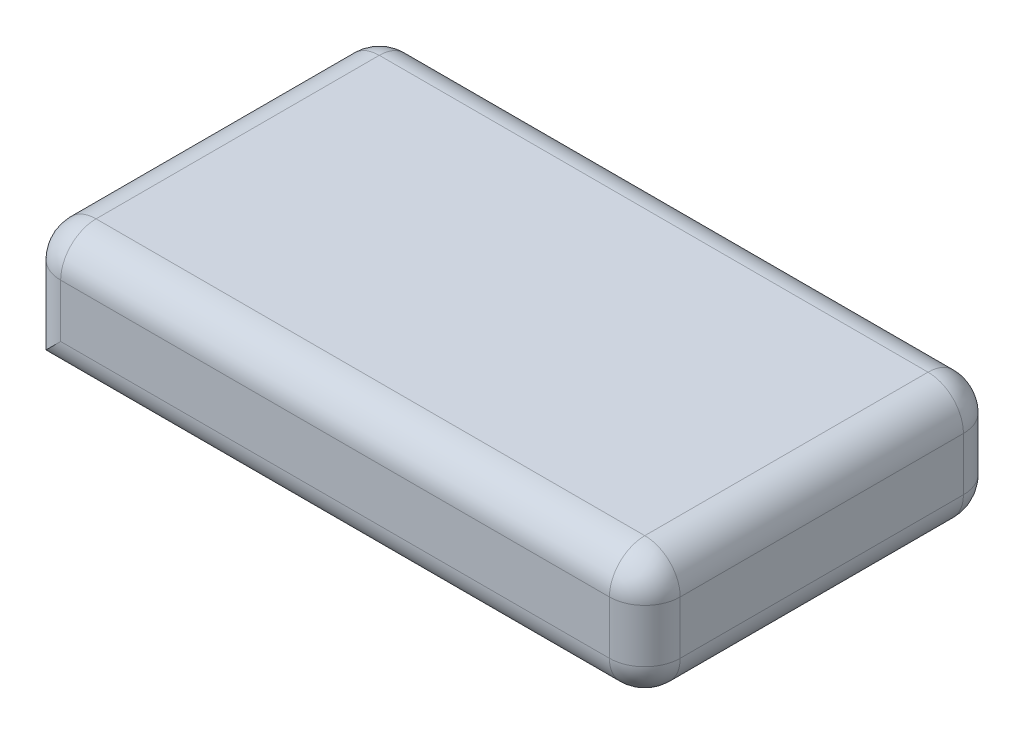
ISO-10303-21;
HEADER;
FILE_DESCRIPTION(('STEP AP214'),'2;1');
FILE_NAME('part.step','',(''),(''),'','','');
FILE_SCHEMA(('AUTOMOTIVE_DESIGN { 1 0 10303 214 1 1 1 1 }'));
ENDSEC;
DATA;
#1=APPLICATION_CONTEXT('core data for automotive mechanical design processes');
#2=APPLICATION_PROTOCOL_DEFINITION('international standard','automotive_design',2000,#1);
#3=PRODUCT_CONTEXT('',#1,'mechanical');
#4=PRODUCT('Part','Part','',(#3));
#5=PRODUCT_RELATED_PRODUCT_CATEGORY('part','',(#4));
#6=PRODUCT_DEFINITION_FORMATION('','',#4);
#7=PRODUCT_DEFINITION_CONTEXT('part definition',#1,'design');
#8=PRODUCT_DEFINITION('design','',#6,#7);
#9=PRODUCT_DEFINITION_SHAPE('','',#8);
#10=(LENGTH_UNIT() NAMED_UNIT(*) SI_UNIT(.MILLI.,.METRE.));
#11=(NAMED_UNIT(*) PLANE_ANGLE_UNIT() SI_UNIT($,.RADIAN.));
#12=(NAMED_UNIT(*) SI_UNIT($,.STERADIAN.) SOLID_ANGLE_UNIT());
#13=UNCERTAINTY_MEASURE_WITH_UNIT(LENGTH_MEASURE(1.E-05),#10,'distance_accuracy_value','');
#14=(GEOMETRIC_REPRESENTATION_CONTEXT(3) GLOBAL_UNCERTAINTY_ASSIGNED_CONTEXT((#13)) GLOBAL_UNIT_ASSIGNED_CONTEXT((#10,
#11,#12)) REPRESENTATION_CONTEXT('',''));
#15=CARTESIAN_POINT('',(0.,0.,0.));
#16=DIRECTION('',(0.,0.,1.));
#17=DIRECTION('',(1.,0.,0.));
#18=AXIS2_PLACEMENT_3D('',#15,#16,#17);
#19=CARTESIAN_POINT('',(17.5,7.,10.));
#20=DIRECTION('',(-1.,0.,0.));
#21=DIRECTION('',(0.,0.,1.));
#22=AXIS2_PLACEMENT_3D('',#19,#20,#21);
#23=PLANE('',#22);
#24=DIRECTION('',(0.,0.,-1.));
#25=VECTOR('',#24,1.);
#26=CARTESIAN_POINT('',(17.5,2.,-10.));
#27=LINE('',#26,#25);
#28=CARTESIAN_POINT('',(17.5,2.,8.));
#29=VERTEX_POINT('',#28);
#30=CARTESIAN_POINT('',(17.5,2.,-8.));
#31=VERTEX_POINT('',#30);
#32=EDGE_CURVE('E42',#29,#31,#27,.T.);
#33=ORIENTED_EDGE('',*,*,#32,.T.);
#34=DIRECTION('',(0.,-1.,0.));
#35=VECTOR('',#34,1.);
#36=CARTESIAN_POINT('',(17.5,7.,-8.));
#37=LINE('',#36,#35);
#38=CARTESIAN_POINT('',(17.5,5.,-8.));
#39=VERTEX_POINT('',#38);
#40=EDGE_CURVE('E11',#31,#39,#37,.F.);
#41=ORIENTED_EDGE('',*,*,#40,.T.);
#42=DIRECTION('',(0.,0.,-1.));
#43=VECTOR('',#42,1.);
#44=CARTESIAN_POINT('',(17.5,5.,10.));
#45=LINE('',#44,#43);
#46=CARTESIAN_POINT('',(17.5,5.,8.));
#47=VERTEX_POINT('',#46);
#48=EDGE_CURVE('E188',#39,#47,#45,.F.);
#49=ORIENTED_EDGE('',*,*,#48,.T.);
#50=DIRECTION('',(0.,-1.,0.));
#51=VECTOR('',#50,1.);
#52=CARTESIAN_POINT('',(17.5,7.,8.));
#53=LINE('',#52,#51);
#54=EDGE_CURVE('E186',#47,#29,#53,.T.);
#55=ORIENTED_EDGE('',*,*,#54,.T.);
#56=EDGE_LOOP('',(#33,#41,#49,#55));
#57=FACE_BOUND('',#56,.T.);
#58=ADVANCED_FACE('F33',(#57),#23,.F.);
#59=CARTESIAN_POINT('',(-17.5,7.,-10.));
#60=DIRECTION('',(0.,0.,1.));
#61=DIRECTION('',(1.,0.,0.));
#62=AXIS2_PLACEMENT_3D('',#59,#60,#61);
#63=PLANE('',#62);
#64=DIRECTION('',(-1.,0.,0.));
#65=VECTOR('',#64,1.);
#66=CARTESIAN_POINT('',(-17.5,2.,-10.));
#67=LINE('',#66,#65);
#68=CARTESIAN_POINT('',(15.5,2.,-10.));
#69=VERTEX_POINT('',#68);
#70=CARTESIAN_POINT('',(-15.5,2.,-10.));
#71=VERTEX_POINT('',#70);
#72=EDGE_CURVE('E163',#69,#71,#67,.T.);
#73=ORIENTED_EDGE('',*,*,#72,.T.);
#74=DIRECTION('',(0.,-1.,0.));
#75=VECTOR('',#74,1.);
#76=CARTESIAN_POINT('',(-15.5,7.,-10.));
#77=LINE('',#76,#75);
#78=CARTESIAN_POINT('',(-15.5,5.,-10.));
#79=VERTEX_POINT('',#78);
#80=EDGE_CURVE('E125',#71,#79,#77,.F.);
#81=ORIENTED_EDGE('',*,*,#80,.T.);
#82=DIRECTION('',(-1.,0.,0.));
#83=VECTOR('',#82,1.);
#84=CARTESIAN_POINT('',(-17.5,5.,-10.));
#85=LINE('',#84,#83);
#86=CARTESIAN_POINT('',(15.5,5.,-10.));
#87=VERTEX_POINT('',#86);
#88=EDGE_CURVE('E161',#79,#87,#85,.F.);
#89=ORIENTED_EDGE('',*,*,#88,.T.);
#90=DIRECTION('',(0.,-1.,0.));
#91=VECTOR('',#90,1.);
#92=CARTESIAN_POINT('',(15.5,7.,-10.));
#93=LINE('',#92,#91);
#94=EDGE_CURVE('E149',#87,#69,#93,.T.);
#95=ORIENTED_EDGE('',*,*,#94,.T.);
#96=EDGE_LOOP('',(#73,#81,#89,#95));
#97=FACE_BOUND('',#96,.T.);
#98=ADVANCED_FACE('F257',(#97),#63,.F.);
#99=CARTESIAN_POINT('',(-17.5,7.,10.));
#100=DIRECTION('',(1.,0.,0.));
#101=DIRECTION('',(0.,0.,-1.));
#102=AXIS2_PLACEMENT_3D('',#99,#100,#101);
#103=PLANE('',#102);
#104=DIRECTION('',(0.,0.,1.));
#105=VECTOR('',#104,1.);
#106=CARTESIAN_POINT('',(-17.5,5.,10.));
#107=LINE('',#106,#105);
#108=CARTESIAN_POINT('',(-17.5,5.,8.));
#109=VERTEX_POINT('',#108);
#110=CARTESIAN_POINT('',(-17.5,5.,-8.));
#111=VERTEX_POINT('',#110);
#112=EDGE_CURVE('E147',#109,#111,#107,.F.);
#113=ORIENTED_EDGE('',*,*,#112,.T.);
#114=DIRECTION('',(0.,-1.,0.));
#115=VECTOR('',#114,1.);
#116=CARTESIAN_POINT('',(-17.5,7.,-8.));
#117=LINE('',#116,#115);
#118=CARTESIAN_POINT('',(-17.5,0.,-8.));
#119=VERTEX_POINT('',#118);
#120=EDGE_CURVE('E123',#111,#119,#117,.T.);
#121=ORIENTED_EDGE('',*,*,#120,.T.);
#122=DIRECTION('',(0.,0.,1.));
#123=VECTOR('',#122,1.);
#124=CARTESIAN_POINT('',(-17.5,0.,10.));
#125=LINE('',#124,#123);
#126=CARTESIAN_POINT('',(-17.5,0.,8.));
#127=VERTEX_POINT('',#126);
#128=EDGE_CURVE('E144',#119,#127,#125,.T.);
#129=ORIENTED_EDGE('',*,*,#128,.T.);
#130=DIRECTION('',(0.,-1.,0.));
#131=VECTOR('',#130,1.);
#132=CARTESIAN_POINT('',(-17.5,7.,8.));
#133=LINE('',#132,#131);
#134=EDGE_CURVE('E150',#127,#109,#133,.F.);
#135=ORIENTED_EDGE('',*,*,#134,.T.);
#136=EDGE_LOOP('',(#113,#121,#129,#135));
#137=FACE_BOUND('',#136,.T.);
#138=ADVANCED_FACE('F143',(#137),#103,.F.);
#139=CARTESIAN_POINT('',(-17.5,7.,10.));
#140=DIRECTION('',(0.,0.,-1.));
#141=DIRECTION('',(-1.,0.,0.));
#142=AXIS2_PLACEMENT_3D('',#139,#140,#141);
#143=PLANE('',#142);
#144=DIRECTION('',(0.,-1.,0.));
#145=VECTOR('',#144,1.);
#146=CARTESIAN_POINT('',(-15.5,7.,10.));
#147=LINE('',#146,#145);
#148=CARTESIAN_POINT('',(-15.5,5.,10.));
#149=VERTEX_POINT('',#148);
#150=CARTESIAN_POINT('',(-15.5,2.,10.));
#151=VERTEX_POINT('',#150);
#152=EDGE_CURVE('E168',#149,#151,#147,.T.);
#153=ORIENTED_EDGE('',*,*,#152,.T.);
#154=DIRECTION('',(1.,0.,0.));
#155=VECTOR('',#154,1.);
#156=CARTESIAN_POINT('',(17.5,2.,10.));
#157=LINE('',#156,#155);
#158=CARTESIAN_POINT('',(15.5,2.,10.));
#159=VERTEX_POINT('',#158);
#160=EDGE_CURVE('E172',#151,#159,#157,.T.);
#161=ORIENTED_EDGE('',*,*,#160,.T.);
#162=DIRECTION('',(0.,-1.,0.));
#163=VECTOR('',#162,1.);
#164=CARTESIAN_POINT('',(15.5,7.,10.));
#165=LINE('',#164,#163);
#166=CARTESIAN_POINT('',(15.5,5.,10.));
#167=VERTEX_POINT('',#166);
#168=EDGE_CURVE('E170',#159,#167,#165,.F.);
#169=ORIENTED_EDGE('',*,*,#168,.T.);
#170=DIRECTION('',(1.,0.,0.));
#171=VECTOR('',#170,1.);
#172=CARTESIAN_POINT('',(-17.5,5.,10.));
#173=LINE('',#172,#171);
#174=EDGE_CURVE('E166',#167,#149,#173,.F.);
#175=ORIENTED_EDGE('',*,*,#174,.T.);
#176=EDGE_LOOP('',(#153,#161,#169,#175));
#177=FACE_BOUND('',#176,.T.);
#178=ADVANCED_FACE('F428',(#177),#143,.F.);
#179=CARTESIAN_POINT('',(0.,7.,0.));
#180=DIRECTION('',(0.,-1.,0.));
#181=DIRECTION('',(0.,0.,-1.));
#182=AXIS2_PLACEMENT_3D('',#179,#180,#181);
#183=PLANE('',#182);
#184=DIRECTION('',(0.,0.,-1.));
#185=VECTOR('',#184,1.);
#186=CARTESIAN_POINT('',(15.5,7.,0.));
#187=LINE('',#186,#185);
#188=CARTESIAN_POINT('',(15.5,7.,8.));
#189=VERTEX_POINT('',#188);
#190=CARTESIAN_POINT('',(15.5,7.,-8.));
#191=VERTEX_POINT('',#190);
#192=EDGE_CURVE('E181',#189,#191,#187,.T.);
#193=ORIENTED_EDGE('',*,*,#192,.T.);
#194=DIRECTION('',(-1.,0.,0.));
#195=VECTOR('',#194,1.);
#196=CARTESIAN_POINT('',(0.,7.,-8.));
#197=LINE('',#196,#195);
#198=CARTESIAN_POINT('',(-15.5,7.,-8.));
#199=VERTEX_POINT('',#198);
#200=EDGE_CURVE('E183',#191,#199,#197,.T.);
#201=ORIENTED_EDGE('',*,*,#200,.T.);
#202=DIRECTION('',(0.,0.,1.));
#203=VECTOR('',#202,1.);
#204=CARTESIAN_POINT('',(-15.5,7.,0.));
#205=LINE('',#204,#203);
#206=CARTESIAN_POINT('',(-15.5,7.,8.));
#207=VERTEX_POINT('',#206);
#208=EDGE_CURVE('E179',#199,#207,#205,.T.);
#209=ORIENTED_EDGE('',*,*,#208,.T.);
#210=DIRECTION('',(1.,0.,0.));
#211=VECTOR('',#210,1.);
#212=CARTESIAN_POINT('',(0.,7.,8.));
#213=LINE('',#212,#211);
#214=EDGE_CURVE('E177',#207,#189,#213,.T.);
#215=ORIENTED_EDGE('',*,*,#214,.T.);
#216=EDGE_LOOP('',(#193,#201,#209,#215));
#217=FACE_BOUND('',#216,.T.);
#218=ADVANCED_FACE('F420',(#217),#183,.F.);
#219=CARTESIAN_POINT('',(0.,0.,0.));
#220=DIRECTION('',(0.,-1.,0.));
#221=DIRECTION('',(0.,0.,-1.));
#222=AXIS2_PLACEMENT_3D('',#219,#220,#221);
#223=PLANE('',#222);
#224=DIRECTION('',(0.,0.,-1.));
#225=VECTOR('',#224,1.);
#226=CARTESIAN_POINT('',(15.5,0.,10.));
#227=LINE('',#226,#225);
#228=CARTESIAN_POINT('',(15.5,0.,-8.));
#229=VERTEX_POINT('',#228);
#230=CARTESIAN_POINT('',(15.5,0.,8.));
#231=VERTEX_POINT('',#230);
#232=EDGE_CURVE('E139',#229,#231,#227,.F.);
#233=ORIENTED_EDGE('',*,*,#232,.T.);
#234=DIRECTION('',(1.,0.,0.));
#235=VECTOR('',#234,1.);
#236=CARTESIAN_POINT('',(-17.5,0.,8.));
#237=LINE('',#236,#235);
#238=EDGE_CURVE('E138',#231,#127,#237,.F.);
#239=ORIENTED_EDGE('',*,*,#238,.T.);
#240=ORIENTED_EDGE('',*,*,#128,.F.);
#241=DIRECTION('',(-1.,0.,0.));
#242=VECTOR('',#241,1.);
#243=CARTESIAN_POINT('',(17.5,0.,-8.));
#244=LINE('',#243,#242);
#245=EDGE_CURVE('E131',#119,#229,#244,.F.);
#246=ORIENTED_EDGE('',*,*,#245,.T.);
#247=EDGE_LOOP('',(#233,#239,#240,#246));
#248=FACE_BOUND('',#247,.T.);
#249=ADVANCED_FACE('F152',(#248),#223,.T.);
#250=CARTESIAN_POINT('',(15.5,5.,8.));
#251=DIRECTION('',(0.,0.,1.));
#252=DIRECTION('',(1.,0.,0.));
#253=AXIS2_PLACEMENT_3D('',#250,#251,#252);
#254=SPHERICAL_SURFACE('',#253,2.);
#255=CARTESIAN_POINT('',(15.5,5.,8.));
#256=DIRECTION('',(1.,0.,0.));
#257=DIRECTION('',(0.,0.,-1.));
#258=AXIS2_PLACEMENT_3D('',#255,#256,#257);
#259=CIRCLE('',#258,2.);
#260=EDGE_CURVE('E230',#167,#189,#259,.F.);
#261=ORIENTED_EDGE('',*,*,#260,.F.);
#262=CARTESIAN_POINT('',(15.5,5.,8.));
#263=DIRECTION('',(0.,1.,0.));
#264=DIRECTION('',(0.,0.,1.));
#265=AXIS2_PLACEMENT_3D('',#262,#263,#264);
#266=CIRCLE('',#265,2.);
#267=EDGE_CURVE('E37',#47,#167,#266,.F.);
#268=ORIENTED_EDGE('',*,*,#267,.F.);
#269=CARTESIAN_POINT('',(15.5,5.,8.));
#270=DIRECTION('',(0.,0.,1.));
#271=DIRECTION('',(1.,0.,0.));
#272=AXIS2_PLACEMENT_3D('',#269,#270,#271);
#273=CIRCLE('',#272,2.);
#274=EDGE_CURVE('E157',#189,#47,#273,.F.);
#275=ORIENTED_EDGE('',*,*,#274,.F.);
#276=EDGE_LOOP('',(#261,#268,#275));
#277=FACE_BOUND('',#276,.T.);
#278=ADVANCED_FACE('F35',(#277),#254,.T.);
#279=CARTESIAN_POINT('',(-17.5,2.,8.));
#280=DIRECTION('',(-1.,0.,0.));
#281=DIRECTION('',(0.,0.,1.));
#282=AXIS2_PLACEMENT_3D('',#279,#280,#281);
#283=CYLINDRICAL_SURFACE('',#282,2.);
#284=CARTESIAN_POINT('',(15.5,2.,8.));
#285=DIRECTION('',(1.,0.,0.));
#286=DIRECTION('',(0.,0.,-1.));
#287=AXIS2_PLACEMENT_3D('',#284,#285,#286);
#288=CIRCLE('',#287,2.);
#289=EDGE_CURVE('E224',#159,#231,#288,.T.);
#290=ORIENTED_EDGE('',*,*,#289,.F.);
#291=ORIENTED_EDGE('',*,*,#160,.F.);
#292=CARTESIAN_POINT('',(-15.5,2.,8.));
#293=DIRECTION('',(0.707106781186547,-0.707106781186547,0.));
#294=DIRECTION('',(-0.707106781186547,-0.707106781186547,0.));
#295=AXIS2_PLACEMENT_3D('',#292,#293,#294);
#296=ELLIPSE('',#295,2.82842712474619,2.);
#297=EDGE_CURVE('E227',#127,#151,#296,.F.);
#298=ORIENTED_EDGE('',*,*,#297,.F.);
#299=ORIENTED_EDGE('',*,*,#238,.F.);
#300=EDGE_LOOP('',(#290,#291,#298,#299));
#301=FACE_BOUND('',#300,.T.);
#302=ADVANCED_FACE('F399',(#301),#283,.T.);
#303=CARTESIAN_POINT('',(15.5,7.,8.));
#304=DIRECTION('',(0.,-1.,0.));
#305=DIRECTION('',(0.,0.,-1.));
#306=AXIS2_PLACEMENT_3D('',#303,#304,#305);
#307=CYLINDRICAL_SURFACE('',#306,2.);
#308=ORIENTED_EDGE('',*,*,#267,.T.);
#309=ORIENTED_EDGE('',*,*,#168,.F.);
#310=CARTESIAN_POINT('',(15.5,2.,8.));
#311=DIRECTION('',(0.,-1.,0.));
#312=DIRECTION('',(0.,0.,-1.));
#313=AXIS2_PLACEMENT_3D('',#310,#311,#312);
#314=CIRCLE('',#313,2.);
#315=EDGE_CURVE('E222',#29,#159,#314,.T.);
#316=ORIENTED_EDGE('',*,*,#315,.F.);
#317=ORIENTED_EDGE('',*,*,#54,.F.);
#318=EDGE_LOOP('',(#308,#309,#316,#317));
#319=FACE_BOUND('',#318,.T.);
#320=ADVANCED_FACE('F247',(#319),#307,.T.);
#321=CARTESIAN_POINT('',(15.5,5.,0.));
#322=DIRECTION('',(0.,0.,-1.));
#323=DIRECTION('',(-1.,0.,0.));
#324=AXIS2_PLACEMENT_3D('',#321,#322,#323);
#325=CYLINDRICAL_SURFACE('',#324,2.);
#326=ORIENTED_EDGE('',*,*,#274,.T.);
#327=ORIENTED_EDGE('',*,*,#48,.F.);
#328=CARTESIAN_POINT('',(15.5,5.,-8.));
#329=DIRECTION('',(0.,0.,-1.));
#330=DIRECTION('',(-1.,0.,0.));
#331=AXIS2_PLACEMENT_3D('',#328,#329,#330);
#332=CIRCLE('',#331,2.);
#333=EDGE_CURVE('E220',#191,#39,#332,.T.);
#334=ORIENTED_EDGE('',*,*,#333,.F.);
#335=ORIENTED_EDGE('',*,*,#192,.F.);
#336=EDGE_LOOP('',(#326,#327,#334,#335));
#337=FACE_BOUND('',#336,.T.);
#338=ADVANCED_FACE('F238',(#337),#325,.T.);
#339=CARTESIAN_POINT('',(0.,5.,8.));
#340=DIRECTION('',(1.,0.,0.));
#341=DIRECTION('',(0.,0.,-1.));
#342=AXIS2_PLACEMENT_3D('',#339,#340,#341);
#343=CYLINDRICAL_SURFACE('',#342,2.);
#344=ORIENTED_EDGE('',*,*,#260,.T.);
#345=ORIENTED_EDGE('',*,*,#214,.F.);
#346=CARTESIAN_POINT('',(-15.5,5.,8.));
#347=DIRECTION('',(-1.,0.,0.));
#348=DIRECTION('',(0.,0.,1.));
#349=AXIS2_PLACEMENT_3D('',#346,#347,#348);
#350=CIRCLE('',#349,2.);
#351=EDGE_CURVE('E217',#149,#207,#350,.T.);
#352=ORIENTED_EDGE('',*,*,#351,.F.);
#353=ORIENTED_EDGE('',*,*,#174,.F.);
#354=EDGE_LOOP('',(#344,#345,#352,#353));
#355=FACE_BOUND('',#354,.T.);
#356=ADVANCED_FACE('F375',(#355),#343,.T.);
#357=CARTESIAN_POINT('',(-15.5,7.,8.));
#358=DIRECTION('',(0.,-1.,0.));
#359=DIRECTION('',(0.,0.,-1.));
#360=AXIS2_PLACEMENT_3D('',#357,#358,#359);
#361=CYLINDRICAL_SURFACE('',#360,2.);
#362=ORIENTED_EDGE('',*,*,#297,.T.);
#363=ORIENTED_EDGE('',*,*,#152,.F.);
#364=CARTESIAN_POINT('',(-15.5,5.,8.));
#365=DIRECTION('',(0.,1.,0.));
#366=DIRECTION('',(0.,0.,1.));
#367=AXIS2_PLACEMENT_3D('',#364,#365,#366);
#368=CIRCLE('',#367,2.);
#369=EDGE_CURVE('E214',#109,#149,#368,.T.);
#370=ORIENTED_EDGE('',*,*,#369,.F.);
#371=ORIENTED_EDGE('',*,*,#134,.F.);
#372=EDGE_LOOP('',(#362,#363,#370,#371));
#373=FACE_BOUND('',#372,.T.);
#374=ADVANCED_FACE('F276',(#373),#361,.T.);
#375=CARTESIAN_POINT('',(15.5,2.,8.));
#376=DIRECTION('',(0.,0.,1.));
#377=DIRECTION('',(1.,0.,0.));
#378=AXIS2_PLACEMENT_3D('',#375,#376,#377);
#379=SPHERICAL_SURFACE('',#378,2.);
#380=ORIENTED_EDGE('',*,*,#315,.T.);
#381=ORIENTED_EDGE('',*,*,#289,.T.);
#382=CARTESIAN_POINT('',(15.5,2.,8.));
#383=DIRECTION('',(0.,0.,1.));
#384=DIRECTION('',(1.,0.,0.));
#385=AXIS2_PLACEMENT_3D('',#382,#383,#384);
#386=CIRCLE('',#385,2.);
#387=EDGE_CURVE('E211',#29,#231,#386,.F.);
#388=ORIENTED_EDGE('',*,*,#387,.F.);
#389=EDGE_LOOP('',(#380,#381,#388));
#390=FACE_BOUND('',#389,.T.);
#391=ADVANCED_FACE('F268',(#390),#379,.T.);
#392=CARTESIAN_POINT('',(15.5,5.,-8.));
#393=DIRECTION('',(0.,0.,1.));
#394=DIRECTION('',(1.,0.,0.));
#395=AXIS2_PLACEMENT_3D('',#392,#393,#394);
#396=SPHERICAL_SURFACE('',#395,2.);
#397=CARTESIAN_POINT('',(15.5,5.,-8.));
#398=DIRECTION('',(1.,0.,0.));
#399=DIRECTION('',(0.,1.,0.));
#400=AXIS2_PLACEMENT_3D('',#397,#398,#399);
#401=CIRCLE('',#400,2.);
#402=EDGE_CURVE('E207',#191,#87,#401,.F.);
#403=ORIENTED_EDGE('',*,*,#402,.F.);
#404=ORIENTED_EDGE('',*,*,#333,.T.);
#405=CARTESIAN_POINT('',(15.5,5.,-8.));
#406=DIRECTION('',(0.,1.,0.));
#407=DIRECTION('',(0.,0.,1.));
#408=AXIS2_PLACEMENT_3D('',#405,#406,#407);
#409=CIRCLE('',#408,2.);
#410=EDGE_CURVE('E55',#87,#39,#409,.F.);
#411=ORIENTED_EDGE('',*,*,#410,.F.);
#412=EDGE_LOOP('',(#403,#404,#411));
#413=FACE_BOUND('',#412,.T.);
#414=ADVANCED_FACE('F265',(#413),#396,.T.);
#415=CARTESIAN_POINT('',(-15.5,5.,8.));
#416=DIRECTION('',(0.,0.,1.));
#417=DIRECTION('',(1.,0.,0.));
#418=AXIS2_PLACEMENT_3D('',#415,#416,#417);
#419=SPHERICAL_SURFACE('',#418,2.);
#420=ORIENTED_EDGE('',*,*,#369,.T.);
#421=ORIENTED_EDGE('',*,*,#351,.T.);
#422=CARTESIAN_POINT('',(-15.5,5.,8.));
#423=DIRECTION('',(0.,0.,1.));
#424=DIRECTION('',(1.,0.,0.));
#425=AXIS2_PLACEMENT_3D('',#422,#423,#424);
#426=CIRCLE('',#425,2.);
#427=EDGE_CURVE('E204',#109,#207,#426,.F.);
#428=ORIENTED_EDGE('',*,*,#427,.F.);
#429=EDGE_LOOP('',(#420,#421,#428));
#430=FACE_BOUND('',#429,.T.);
#431=ADVANCED_FACE('F267',(#430),#419,.T.);
#432=CARTESIAN_POINT('',(15.5,2.,10.));
#433=DIRECTION('',(0.,0.,1.));
#434=DIRECTION('',(1.,0.,0.));
#435=AXIS2_PLACEMENT_3D('',#432,#433,#434);
#436=CYLINDRICAL_SURFACE('',#435,2.);
#437=ORIENTED_EDGE('',*,*,#387,.T.);
#438=ORIENTED_EDGE('',*,*,#232,.F.);
#439=CARTESIAN_POINT('',(15.5,2.,-8.));
#440=DIRECTION('',(0.,0.,-1.));
#441=DIRECTION('',(-1.,0.,0.));
#442=AXIS2_PLACEMENT_3D('',#439,#440,#441);
#443=CIRCLE('',#442,2.);
#444=EDGE_CURVE('E201',#31,#229,#443,.T.);
#445=ORIENTED_EDGE('',*,*,#444,.F.);
#446=ORIENTED_EDGE('',*,*,#32,.F.);
#447=EDGE_LOOP('',(#437,#438,#445,#446));
#448=FACE_BOUND('',#447,.T.);
#449=ADVANCED_FACE('F253',(#448),#436,.T.);
#450=CARTESIAN_POINT('',(15.5,7.,-8.));
#451=DIRECTION('',(0.,-1.,0.));
#452=DIRECTION('',(0.,0.,-1.));
#453=AXIS2_PLACEMENT_3D('',#450,#451,#452);
#454=CYLINDRICAL_SURFACE('',#453,2.);
#455=ORIENTED_EDGE('',*,*,#410,.T.);
#456=ORIENTED_EDGE('',*,*,#40,.F.);
#457=CARTESIAN_POINT('',(15.5,2.,-8.));
#458=DIRECTION('',(0.,-1.,0.));
#459=DIRECTION('',(0.,0.,-1.));
#460=AXIS2_PLACEMENT_3D('',#457,#458,#459);
#461=CIRCLE('',#460,2.);
#462=EDGE_CURVE('E198',#69,#31,#461,.T.);
#463=ORIENTED_EDGE('',*,*,#462,.F.);
#464=ORIENTED_EDGE('',*,*,#94,.F.);
#465=EDGE_LOOP('',(#455,#456,#463,#464));
#466=FACE_BOUND('',#465,.T.);
#467=ADVANCED_FACE('F251',(#466),#454,.T.);
#468=CARTESIAN_POINT('',(0.,5.,-8.));
#469=DIRECTION('',(-1.,0.,0.));
#470=DIRECTION('',(0.,0.,1.));
#471=AXIS2_PLACEMENT_3D('',#468,#469,#470);
#472=CYLINDRICAL_SURFACE('',#471,2.);
#473=ORIENTED_EDGE('',*,*,#402,.T.);
#474=ORIENTED_EDGE('',*,*,#88,.F.);
#475=CARTESIAN_POINT('',(-15.5,5.,-8.));
#476=DIRECTION('',(-1.,0.,0.));
#477=DIRECTION('',(0.,0.,1.));
#478=AXIS2_PLACEMENT_3D('',#475,#476,#477);
#479=CIRCLE('',#478,2.);
#480=EDGE_CURVE('E195',#199,#79,#479,.T.);
#481=ORIENTED_EDGE('',*,*,#480,.F.);
#482=ORIENTED_EDGE('',*,*,#200,.F.);
#483=EDGE_LOOP('',(#473,#474,#481,#482));
#484=FACE_BOUND('',#483,.T.);
#485=ADVANCED_FACE('F263',(#484),#472,.T.);
#486=CARTESIAN_POINT('',(-15.5,5.,0.));
#487=DIRECTION('',(0.,0.,1.));
#488=DIRECTION('',(1.,0.,0.));
#489=AXIS2_PLACEMENT_3D('',#486,#487,#488);
#490=CYLINDRICAL_SURFACE('',#489,2.);
#491=ORIENTED_EDGE('',*,*,#427,.T.);
#492=ORIENTED_EDGE('',*,*,#208,.F.);
#493=CARTESIAN_POINT('',(-15.5,5.,-8.));
#494=DIRECTION('',(0.,0.,-1.));
#495=DIRECTION('',(0.,1.,0.));
#496=AXIS2_PLACEMENT_3D('',#493,#494,#495);
#497=CIRCLE('',#496,2.);
#498=EDGE_CURVE('E193',#111,#199,#497,.T.);
#499=ORIENTED_EDGE('',*,*,#498,.F.);
#500=ORIENTED_EDGE('',*,*,#112,.F.);
#501=EDGE_LOOP('',(#491,#492,#499,#500));
#502=FACE_BOUND('',#501,.T.);
#503=ADVANCED_FACE('F297',(#502),#490,.T.);
#504=CARTESIAN_POINT('',(15.5,2.,-8.));
#505=DIRECTION('',(0.,0.,1.));
#506=DIRECTION('',(1.,0.,0.));
#507=AXIS2_PLACEMENT_3D('',#504,#505,#506);
#508=SPHERICAL_SURFACE('',#507,2.);
#509=ORIENTED_EDGE('',*,*,#462,.T.);
#510=ORIENTED_EDGE('',*,*,#444,.T.);
#511=CARTESIAN_POINT('',(15.5,2.,-8.));
#512=DIRECTION('',(1.,0.,0.));
#513=DIRECTION('',(0.,0.,-1.));
#514=AXIS2_PLACEMENT_3D('',#511,#512,#513);
#515=CIRCLE('',#514,2.);
#516=EDGE_CURVE('E134',#69,#229,#515,.F.);
#517=ORIENTED_EDGE('',*,*,#516,.F.);
#518=EDGE_LOOP('',(#509,#510,#517));
#519=FACE_BOUND('',#518,.T.);
#520=ADVANCED_FACE('F255',(#519),#508,.T.);
#521=CARTESIAN_POINT('',(-15.5,5.,-8.));
#522=DIRECTION('',(0.,0.,1.));
#523=DIRECTION('',(1.,0.,0.));
#524=AXIS2_PLACEMENT_3D('',#521,#522,#523);
#525=SPHERICAL_SURFACE('',#524,2.);
#526=ORIENTED_EDGE('',*,*,#498,.T.);
#527=ORIENTED_EDGE('',*,*,#480,.T.);
#528=CARTESIAN_POINT('',(-15.5,5.,-8.));
#529=DIRECTION('',(0.,1.,0.));
#530=DIRECTION('',(0.,0.,1.));
#531=AXIS2_PLACEMENT_3D('',#528,#529,#530);
#532=CIRCLE('',#531,2.);
#533=EDGE_CURVE('E128',#111,#79,#532,.F.);
#534=ORIENTED_EDGE('',*,*,#533,.F.);
#535=EDGE_LOOP('',(#526,#527,#534));
#536=FACE_BOUND('',#535,.T.);
#537=ADVANCED_FACE('F291',(#536),#525,.T.);
#538=CARTESIAN_POINT('',(-17.5,2.,-8.));
#539=DIRECTION('',(1.,0.,0.));
#540=DIRECTION('',(0.,0.,-1.));
#541=AXIS2_PLACEMENT_3D('',#538,#539,#540);
#542=CYLINDRICAL_SURFACE('',#541,2.);
#543=ORIENTED_EDGE('',*,*,#516,.T.);
#544=ORIENTED_EDGE('',*,*,#245,.F.);
#545=CARTESIAN_POINT('',(-15.5,2.,-8.));
#546=DIRECTION('',(0.707106781186547,-0.707106781186547,0.));
#547=DIRECTION('',(0.707106781186547,0.707106781186547,0.));
#548=AXIS2_PLACEMENT_3D('',#545,#546,#547);
#549=ELLIPSE('',#548,2.82842712474619,2.);
#550=EDGE_CURVE('E119',#71,#119,#549,.F.);
#551=ORIENTED_EDGE('',*,*,#550,.F.);
#552=ORIENTED_EDGE('',*,*,#72,.F.);
#553=EDGE_LOOP('',(#543,#544,#551,#552));
#554=FACE_BOUND('',#553,.T.);
#555=ADVANCED_FACE('F132',(#554),#542,.T.);
#556=CARTESIAN_POINT('',(-15.5,7.,-8.));
#557=DIRECTION('',(0.,-1.,0.));
#558=DIRECTION('',(0.,0.,-1.));
#559=AXIS2_PLACEMENT_3D('',#556,#557,#558);
#560=CYLINDRICAL_SURFACE('',#559,2.);
#561=ORIENTED_EDGE('',*,*,#533,.T.);
#562=ORIENTED_EDGE('',*,*,#80,.F.);
#563=ORIENTED_EDGE('',*,*,#550,.T.);
#564=ORIENTED_EDGE('',*,*,#120,.F.);
#565=EDGE_LOOP('',(#561,#562,#563,#564));
#566=FACE_BOUND('',#565,.T.);
#567=ADVANCED_FACE('F121',(#566),#560,.T.);
#568=CLOSED_SHELL('',(#58,#98,#138,#178,#218,#249,#278,#302,#320,#338,#356,#374,#391,#414,#431,
#449,#467,#485,#503,#520,#537,#555,#567));
#569=MANIFOLD_SOLID_BREP('B2',#568);
#570=ADVANCED_BREP_SHAPE_REPRESENTATION('',(#18,#569),#14);
#571=SHAPE_DEFINITION_REPRESENTATION(#9,#570);
ENDSEC;
END-ISO-10303-21;
